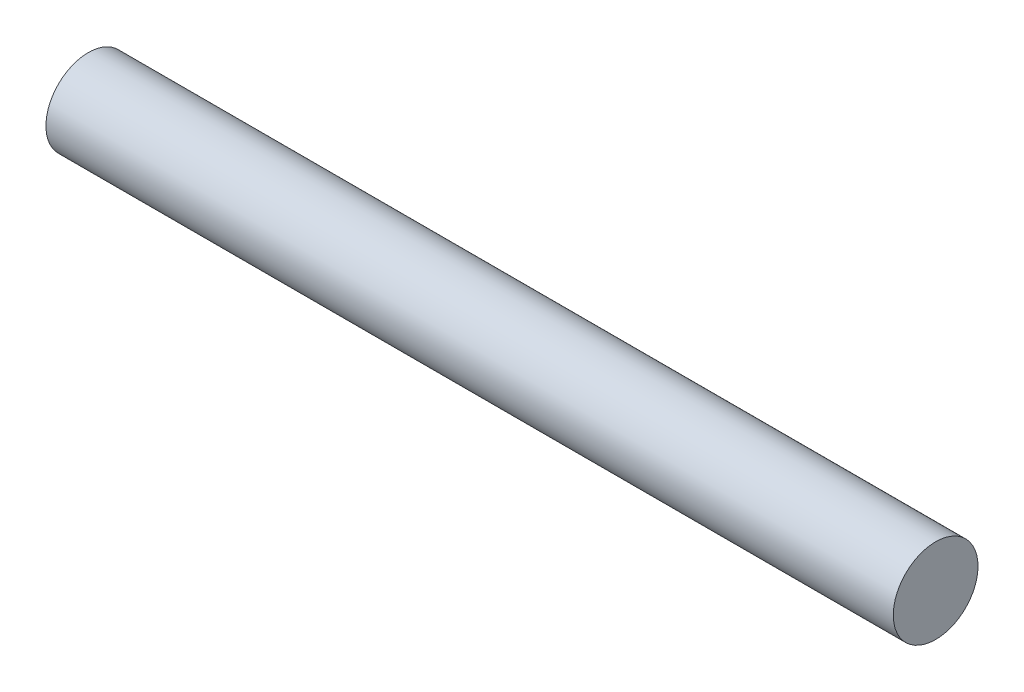
ISO-10303-21;
HEADER;
FILE_DESCRIPTION(('STEP AP214'),'2;1');
FILE_NAME('part.step','',(''),(''),'','','');
FILE_SCHEMA(('AUTOMOTIVE_DESIGN { 1 0 10303 214 1 1 1 1 }'));
ENDSEC;
DATA;
#1=APPLICATION_CONTEXT('core data for automotive mechanical design processes');
#2=APPLICATION_PROTOCOL_DEFINITION('international standard','automotive_design',2000,#1);
#3=PRODUCT_CONTEXT('',#1,'mechanical');
#4=PRODUCT('Part','Part','',(#3));
#5=PRODUCT_RELATED_PRODUCT_CATEGORY('part','',(#4));
#6=PRODUCT_DEFINITION_FORMATION('','',#4);
#7=PRODUCT_DEFINITION_CONTEXT('part definition',#1,'design');
#8=PRODUCT_DEFINITION('design','',#6,#7);
#9=PRODUCT_DEFINITION_SHAPE('','',#8);
#10=(LENGTH_UNIT() NAMED_UNIT(*) SI_UNIT(.MILLI.,.METRE.));
#11=(NAMED_UNIT(*) PLANE_ANGLE_UNIT() SI_UNIT($,.RADIAN.));
#12=(NAMED_UNIT(*) SI_UNIT($,.STERADIAN.) SOLID_ANGLE_UNIT());
#13=UNCERTAINTY_MEASURE_WITH_UNIT(LENGTH_MEASURE(1.E-05),#10,'distance_accuracy_value','');
#14=(GEOMETRIC_REPRESENTATION_CONTEXT(3) GLOBAL_UNCERTAINTY_ASSIGNED_CONTEXT((#13)) GLOBAL_UNIT_ASSIGNED_CONTEXT((#10,
#11,#12)) REPRESENTATION_CONTEXT('',''));
#15=CARTESIAN_POINT('',(0.,0.,0.));
#16=DIRECTION('',(0.,0.,1.));
#17=DIRECTION('',(1.,0.,0.));
#18=AXIS2_PLACEMENT_3D('',#15,#16,#17);
#19=CARTESIAN_POINT('',(200.,0.,0.));
#20=DIRECTION('',(-1.,0.,0.));
#21=DIRECTION('',(0.,0.,1.));
#22=AXIS2_PLACEMENT_3D('',#19,#20,#21);
#23=CYLINDRICAL_SURFACE('',#22,10.);
#24=CARTESIAN_POINT('',(200.,0.,0.));
#25=DIRECTION('',(1.,0.,0.));
#26=DIRECTION('',(0.,0.,-1.));
#27=AXIS2_PLACEMENT_3D('',#24,#25,#26);
#28=CIRCLE('',#27,10.);
#29=CARTESIAN_POINT('',(200.,0.,-10.));
#30=VERTEX_POINT('',#29);
#31=EDGE_CURVE('E10',#30,#30,#28,.T.);
#32=ORIENTED_EDGE('',*,*,#31,.F.);
#33=EDGE_LOOP('',(#32));
#34=FACE_BOUND('',#33,.T.);
#35=CARTESIAN_POINT('',(0.,0.,0.));
#36=DIRECTION('',(1.,0.,0.));
#37=DIRECTION('',(0.,0.,-1.));
#38=AXIS2_PLACEMENT_3D('',#35,#36,#37);
#39=CIRCLE('',#38,10.);
#40=CARTESIAN_POINT('',(0.,0.,-10.));
#41=VERTEX_POINT('',#40);
#42=EDGE_CURVE('E35',#41,#41,#39,.T.);
#43=ORIENTED_EDGE('',*,*,#42,.T.);
#44=EDGE_LOOP('',(#43));
#45=FACE_BOUND('',#44,.T.);
#46=ADVANCED_FACE('F29',(#34,#45),#23,.T.);
#47=CARTESIAN_POINT('',(200.,0.,0.));
#48=DIRECTION('',(1.,0.,0.));
#49=DIRECTION('',(0.,0.,-1.));
#50=AXIS2_PLACEMENT_3D('',#47,#48,#49);
#51=PLANE('',#50);
#52=ORIENTED_EDGE('',*,*,#31,.T.);
#53=EDGE_LOOP('',(#52));
#54=FACE_BOUND('',#53,.T.);
#55=ADVANCED_FACE('F44',(#54),#51,.T.);
#56=CARTESIAN_POINT('',(0.,0.,0.));
#57=DIRECTION('',(1.,0.,0.));
#58=DIRECTION('',(0.,0.,-1.));
#59=AXIS2_PLACEMENT_3D('',#56,#57,#58);
#60=PLANE('',#59);
#61=ORIENTED_EDGE('',*,*,#42,.F.);
#62=EDGE_LOOP('',(#61));
#63=FACE_BOUND('',#62,.T.);
#64=ADVANCED_FACE('F42',(#63),#60,.F.);
#65=CLOSED_SHELL('',(#46,#55,#64));
#66=MANIFOLD_SOLID_BREP('B2',#65);
#67=ADVANCED_BREP_SHAPE_REPRESENTATION('',(#18,#66),#14);
#68=SHAPE_DEFINITION_REPRESENTATION(#9,#67);
ENDSEC;
END-ISO-10303-21;
